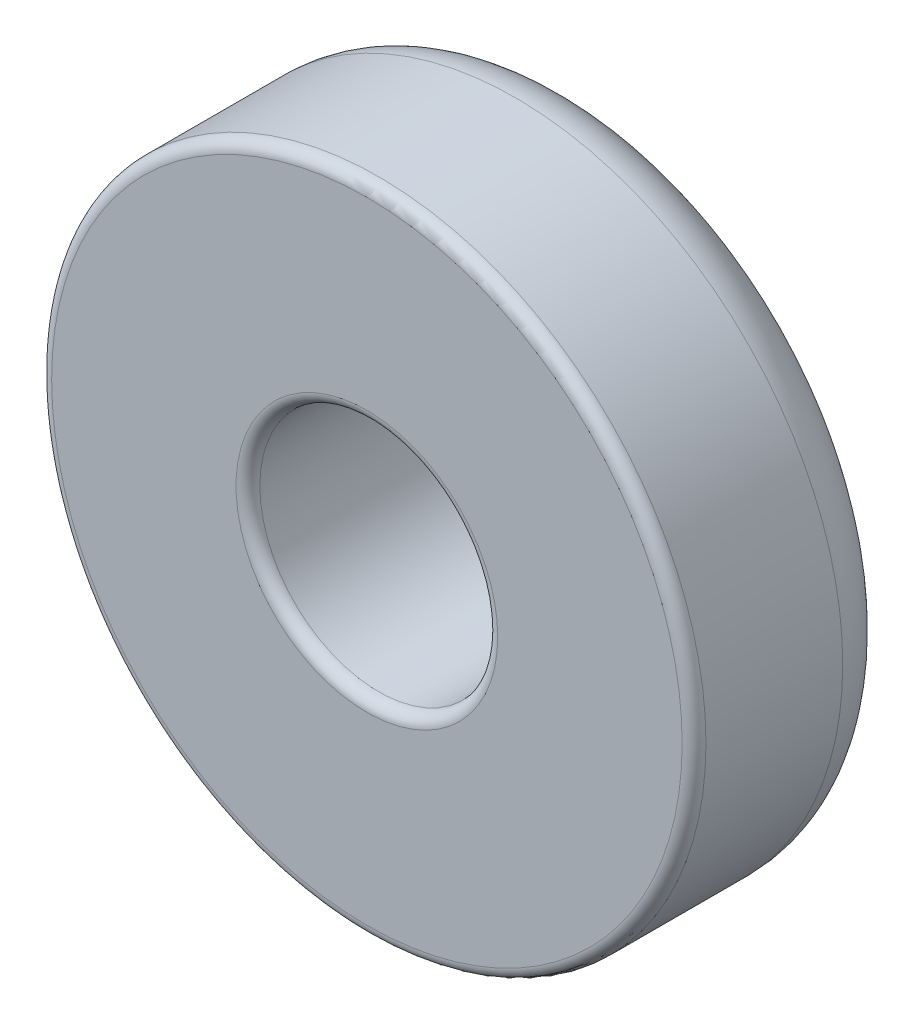
ISO-10303-21;
HEADER;
FILE_DESCRIPTION(('STEP AP214'),'2;1');
FILE_NAME('part.step','',(''),(''),'','','');
FILE_SCHEMA(('AUTOMOTIVE_DESIGN { 1 0 10303 214 1 1 1 1 }'));
ENDSEC;
DATA;
#1=APPLICATION_CONTEXT('core data for automotive mechanical design processes');
#2=APPLICATION_PROTOCOL_DEFINITION('international standard','automotive_design',2000,#1);
#3=PRODUCT_CONTEXT('',#1,'mechanical');
#4=PRODUCT('Part','Part','',(#3));
#5=PRODUCT_RELATED_PRODUCT_CATEGORY('part','',(#4));
#6=PRODUCT_DEFINITION_FORMATION('','',#4);
#7=PRODUCT_DEFINITION_CONTEXT('part definition',#1,'design');
#8=PRODUCT_DEFINITION('design','',#6,#7);
#9=PRODUCT_DEFINITION_SHAPE('','',#8);
#10=(LENGTH_UNIT() NAMED_UNIT(*) SI_UNIT(.MILLI.,.METRE.));
#11=(NAMED_UNIT(*) PLANE_ANGLE_UNIT() SI_UNIT($,.RADIAN.));
#12=(NAMED_UNIT(*) SI_UNIT($,.STERADIAN.) SOLID_ANGLE_UNIT());
#13=UNCERTAINTY_MEASURE_WITH_UNIT(LENGTH_MEASURE(1.E-05),#10,'distance_accuracy_value','');
#14=(GEOMETRIC_REPRESENTATION_CONTEXT(3) GLOBAL_UNCERTAINTY_ASSIGNED_CONTEXT((#13)) GLOBAL_UNIT_ASSIGNED_CONTEXT((#10,
#11,#12)) REPRESENTATION_CONTEXT('',''));
#15=CARTESIAN_POINT('',(0.,0.,0.));
#16=DIRECTION('',(0.,0.,1.));
#17=DIRECTION('',(1.,0.,0.));
#18=AXIS2_PLACEMENT_3D('',#15,#16,#17);
#19=CARTESIAN_POINT('',(0.,0.,1.75));
#20=DIRECTION('',(0.,0.,1.));
#21=DIRECTION('',(1.,0.,0.));
#22=AXIS2_PLACEMENT_3D('',#19,#20,#21);
#23=PLANE('',#22);
#24=CARTESIAN_POINT('',(0.,0.,1.75));
#25=DIRECTION('',(0.,0.,1.));
#26=DIRECTION('',(1.,0.,0.));
#27=AXIS2_PLACEMENT_3D('',#24,#25,#26);
#28=CIRCLE('',#27,1.1);
#29=CARTESIAN_POINT('',(1.1,0.,1.75));
#30=VERTEX_POINT('',#29);
#31=EDGE_CURVE('E53',#30,#30,#28,.F.);
#32=ORIENTED_EDGE('',*,*,#31,.T.);
#33=EDGE_LOOP('',(#32));
#34=FACE_BOUND('',#33,.T.);
#35=CARTESIAN_POINT('',(0.,0.,1.75));
#36=DIRECTION('',(0.,0.,1.));
#37=DIRECTION('',(1.,0.,0.));
#38=AXIS2_PLACEMENT_3D('',#35,#36,#37);
#39=CIRCLE('',#38,2.65);
#40=CARTESIAN_POINT('',(2.65,0.,1.75));
#41=VERTEX_POINT('',#40);
#42=EDGE_CURVE('E58',#41,#41,#39,.T.);
#43=ORIENTED_EDGE('',*,*,#42,.T.);
#44=EDGE_LOOP('',(#43));
#45=FACE_BOUND('',#44,.T.);
#46=ADVANCED_FACE('F38',(#34,#45),#23,.T.);
#47=CARTESIAN_POINT('',(0.,0.,0.));
#48=DIRECTION('',(0.,0.,1.));
#49=DIRECTION('',(1.,0.,0.));
#50=AXIS2_PLACEMENT_3D('',#47,#48,#49);
#51=PLANE('',#50);
#52=CARTESIAN_POINT('',(0.,0.,0.));
#53=DIRECTION('',(0.,0.,1.));
#54=DIRECTION('',(1.,0.,0.));
#55=AXIS2_PLACEMENT_3D('',#52,#53,#54);
#56=CIRCLE('',#55,1.1);
#57=CARTESIAN_POINT('',(1.1,0.,0.));
#58=VERTEX_POINT('',#57);
#59=EDGE_CURVE('E45',#58,#58,#56,.T.);
#60=ORIENTED_EDGE('',*,*,#59,.T.);
#61=EDGE_LOOP('',(#60));
#62=FACE_BOUND('',#61,.T.);
#63=CARTESIAN_POINT('',(0.,0.,0.));
#64=DIRECTION('',(0.,0.,1.));
#65=DIRECTION('',(1.,0.,0.));
#66=AXIS2_PLACEMENT_3D('',#63,#64,#65);
#67=CIRCLE('',#66,2.25);
#68=CARTESIAN_POINT('',(2.25,0.,0.));
#69=VERTEX_POINT('',#68);
#70=EDGE_CURVE('E64',#69,#69,#67,.F.);
#71=ORIENTED_EDGE('',*,*,#70,.T.);
#72=EDGE_LOOP('',(#71));
#73=FACE_BOUND('',#72,.T.);
#74=ADVANCED_FACE('F90',(#62,#73),#51,.F.);
#75=CARTESIAN_POINT('',(0.,0.,1.75));
#76=DIRECTION('',(0.,0.,-1.));
#77=DIRECTION('',(-1.,0.,0.));
#78=AXIS2_PLACEMENT_3D('',#75,#76,#77);
#79=CYLINDRICAL_SURFACE('',#78,2.75);
#80=CARTESIAN_POINT('',(0.,0.,1.65));
#81=DIRECTION('',(0.,0.,1.));
#82=DIRECTION('',(1.,0.,0.));
#83=AXIS2_PLACEMENT_3D('',#80,#81,#82);
#84=CIRCLE('',#83,2.75);
#85=CARTESIAN_POINT('',(2.75,0.,1.65));
#86=VERTEX_POINT('',#85);
#87=EDGE_CURVE('E49',#86,#86,#84,.F.);
#88=ORIENTED_EDGE('',*,*,#87,.T.);
#89=EDGE_LOOP('',(#88));
#90=FACE_BOUND('',#89,.T.);
#91=CARTESIAN_POINT('',(0.,0.,0.5));
#92=DIRECTION('',(0.,0.,1.));
#93=DIRECTION('',(1.,0.,0.));
#94=AXIS2_PLACEMENT_3D('',#91,#92,#93);
#95=CIRCLE('',#94,2.75);
#96=CARTESIAN_POINT('',(2.75,0.,0.5));
#97=VERTEX_POINT('',#96);
#98=EDGE_CURVE('E67',#97,#97,#95,.T.);
#99=ORIENTED_EDGE('',*,*,#98,.T.);
#100=EDGE_LOOP('',(#99));
#101=FACE_BOUND('',#100,.T.);
#102=ADVANCED_FACE('F71',(#90,#101),#79,.T.);
#103=CARTESIAN_POINT('',(0.,0.,1.75));
#104=DIRECTION('',(0.,0.,-1.));
#105=DIRECTION('',(-1.,0.,0.));
#106=AXIS2_PLACEMENT_3D('',#103,#104,#105);
#107=CYLINDRICAL_SURFACE('',#106,1.);
#108=CARTESIAN_POINT('',(0.,0.,0.1));
#109=DIRECTION('',(0.,0.,1.));
#110=DIRECTION('',(1.,0.,0.));
#111=AXIS2_PLACEMENT_3D('',#108,#109,#110);
#112=CIRCLE('',#111,1.);
#113=CARTESIAN_POINT('',(1.,0.,0.1));
#114=VERTEX_POINT('',#113);
#115=EDGE_CURVE('E11',#114,#114,#112,.F.);
#116=ORIENTED_EDGE('',*,*,#115,.T.);
#117=EDGE_LOOP('',(#116));
#118=FACE_BOUND('',#117,.T.);
#119=CARTESIAN_POINT('',(0.,0.,1.65));
#120=DIRECTION('',(0.,0.,1.));
#121=DIRECTION('',(1.,0.,0.));
#122=AXIS2_PLACEMENT_3D('',#119,#120,#121);
#123=CIRCLE('',#122,1.);
#124=CARTESIAN_POINT('',(1.,0.,1.65));
#125=VERTEX_POINT('',#124);
#126=EDGE_CURVE('E61',#125,#125,#123,.T.);
#127=ORIENTED_EDGE('',*,*,#126,.T.);
#128=EDGE_LOOP('',(#127));
#129=FACE_BOUND('',#128,.T.);
#130=ADVANCED_FACE('F76',(#118,#129),#107,.F.);
#131=CARTESIAN_POINT('',(0.,0.,0.5));
#132=DIRECTION('',(0.,0.,1.));
#133=DIRECTION('',(1.,0.,0.));
#134=AXIS2_PLACEMENT_3D('',#131,#132,#133);
#135=TOROIDAL_SURFACE('',#134,2.25,0.5);
#136=ORIENTED_EDGE('',*,*,#70,.F.);
#137=EDGE_LOOP('',(#136));
#138=FACE_BOUND('',#137,.T.);
#139=ORIENTED_EDGE('',*,*,#98,.F.);
#140=EDGE_LOOP('',(#139));
#141=FACE_BOUND('',#140,.T.);
#142=ADVANCED_FACE('F73',(#138,#141),#135,.T.);
#143=CARTESIAN_POINT('',(0.,0.,1.65));
#144=DIRECTION('',(0.,0.,1.));
#145=DIRECTION('',(1.,0.,0.));
#146=AXIS2_PLACEMENT_3D('',#143,#144,#145);
#147=TOROIDAL_SURFACE('',#146,1.1,0.1);
#148=ORIENTED_EDGE('',*,*,#31,.F.);
#149=EDGE_LOOP('',(#148));
#150=FACE_BOUND('',#149,.T.);
#151=ORIENTED_EDGE('',*,*,#126,.F.);
#152=EDGE_LOOP('',(#151));
#153=FACE_BOUND('',#152,.T.);
#154=ADVANCED_FACE('F75',(#150,#153),#147,.T.);
#155=CARTESIAN_POINT('',(0.,0.,1.65));
#156=DIRECTION('',(0.,0.,1.));
#157=DIRECTION('',(1.,0.,0.));
#158=AXIS2_PLACEMENT_3D('',#155,#156,#157);
#159=TOROIDAL_SURFACE('',#158,2.65,0.1);
#160=ORIENTED_EDGE('',*,*,#87,.F.);
#161=EDGE_LOOP('',(#160));
#162=FACE_BOUND('',#161,.T.);
#163=ORIENTED_EDGE('',*,*,#42,.F.);
#164=EDGE_LOOP('',(#163));
#165=FACE_BOUND('',#164,.T.);
#166=ADVANCED_FACE('F83',(#162,#165),#159,.T.);
#167=CARTESIAN_POINT('',(0.,0.,0.1));
#168=DIRECTION('',(0.,0.,1.));
#169=DIRECTION('',(1.,0.,0.));
#170=AXIS2_PLACEMENT_3D('',#167,#168,#169);
#171=TOROIDAL_SURFACE('',#170,1.1,0.1);
#172=ORIENTED_EDGE('',*,*,#115,.F.);
#173=EDGE_LOOP('',(#172));
#174=FACE_BOUND('',#173,.T.);
#175=ORIENTED_EDGE('',*,*,#59,.F.);
#176=EDGE_LOOP('',(#175));
#177=FACE_BOUND('',#176,.T.);
#178=ADVANCED_FACE('F40',(#174,#177),#171,.T.);
#179=CLOSED_SHELL('',(#46,#74,#102,#130,#142,#154,#166,#178));
#180=MANIFOLD_SOLID_BREP('B2',#179);
#181=ADVANCED_BREP_SHAPE_REPRESENTATION('',(#18,#180),#14);
#182=SHAPE_DEFINITION_REPRESENTATION(#9,#181);
ENDSEC;
END-ISO-10303-21;
